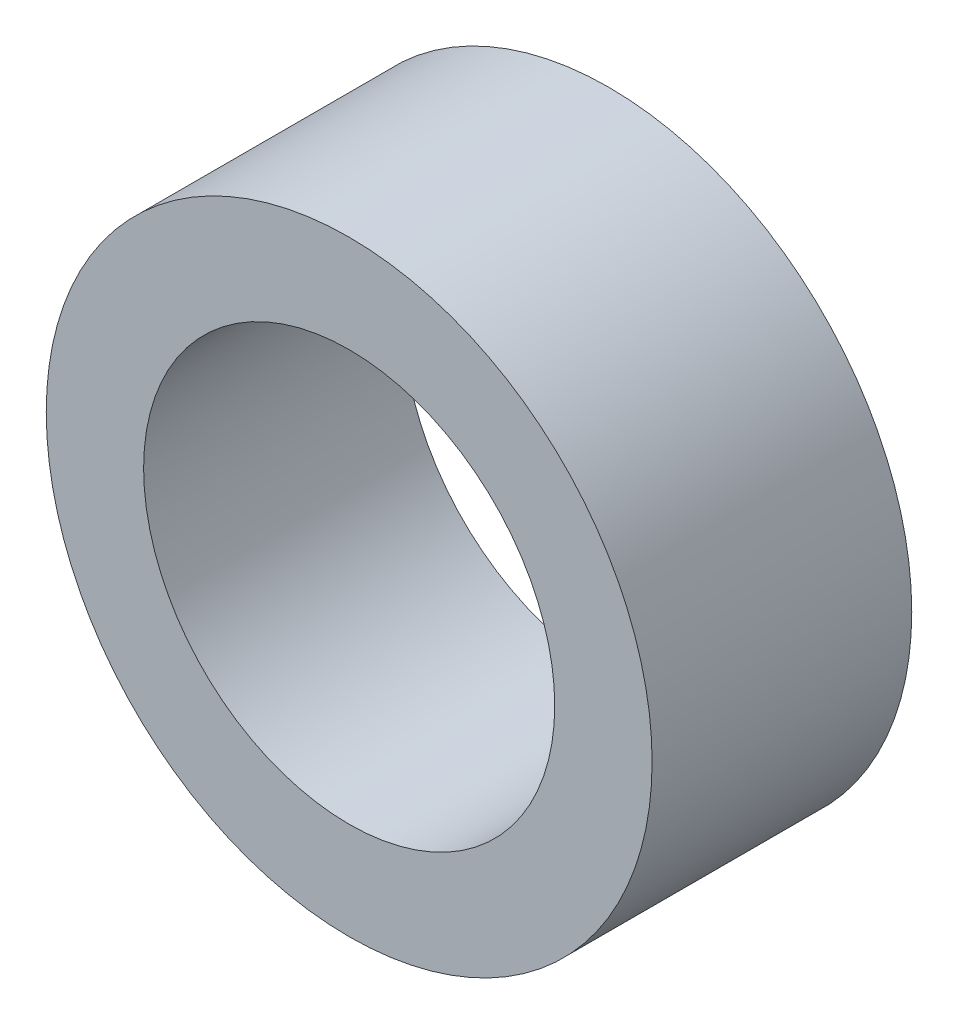
ISO-10303-21;
HEADER;
FILE_DESCRIPTION(('STEP AP214'),'2;1');
FILE_NAME('part.step','',(''),(''),'','','');
FILE_SCHEMA(('AUTOMOTIVE_DESIGN { 1 0 10303 214 1 1 1 1 }'));
ENDSEC;
DATA;
#1=APPLICATION_CONTEXT('core data for automotive mechanical design processes');
#2=APPLICATION_PROTOCOL_DEFINITION('international standard','automotive_design',2000,#1);
#3=PRODUCT_CONTEXT('',#1,'mechanical');
#4=PRODUCT('Part','Part','',(#3));
#5=PRODUCT_RELATED_PRODUCT_CATEGORY('part','',(#4));
#6=PRODUCT_DEFINITION_FORMATION('','',#4);
#7=PRODUCT_DEFINITION_CONTEXT('part definition',#1,'design');
#8=PRODUCT_DEFINITION('design','',#6,#7);
#9=PRODUCT_DEFINITION_SHAPE('','',#8);
#10=(LENGTH_UNIT() NAMED_UNIT(*) SI_UNIT(.MILLI.,.METRE.));
#11=(NAMED_UNIT(*) PLANE_ANGLE_UNIT() SI_UNIT($,.RADIAN.));
#12=(NAMED_UNIT(*) SI_UNIT($,.STERADIAN.) SOLID_ANGLE_UNIT());
#13=UNCERTAINTY_MEASURE_WITH_UNIT(LENGTH_MEASURE(1.E-05),#10,'distance_accuracy_value','');
#14=(GEOMETRIC_REPRESENTATION_CONTEXT(3) GLOBAL_UNCERTAINTY_ASSIGNED_CONTEXT((#13)) GLOBAL_UNIT_ASSIGNED_CONTEXT((#10,
#11,#12)) REPRESENTATION_CONTEXT('',''));
#15=CARTESIAN_POINT('',(0.,0.,0.));
#16=DIRECTION('',(0.,0.,1.));
#17=DIRECTION('',(1.,0.,0.));
#18=AXIS2_PLACEMENT_3D('',#15,#16,#17);
#19=CARTESIAN_POINT('',(0.,0.,3.));
#20=DIRECTION('',(0.,0.,1.));
#21=DIRECTION('',(1.,0.,0.));
#22=AXIS2_PLACEMENT_3D('',#19,#20,#21);
#23=PLANE('',#22);
#24=CARTESIAN_POINT('',(0.,0.,3.));
#25=DIRECTION('',(0.,0.,1.));
#26=DIRECTION('',(1.,0.,0.));
#27=AXIS2_PLACEMENT_3D('',#24,#25,#26);
#28=CIRCLE('',#27,3.5);
#29=CARTESIAN_POINT('',(3.5,0.,3.));
#30=VERTEX_POINT('',#29);
#31=EDGE_CURVE('E10',#30,#30,#28,.T.);
#32=ORIENTED_EDGE('',*,*,#31,.T.);
#33=EDGE_LOOP('',(#32));
#34=FACE_BOUND('',#33,.T.);
#35=CARTESIAN_POINT('',(0.,0.,3.));
#36=DIRECTION('',(0.,0.,1.));
#37=DIRECTION('',(1.,0.,0.));
#38=AXIS2_PLACEMENT_3D('',#35,#36,#37);
#39=CIRCLE('',#38,2.375);
#40=CARTESIAN_POINT('',(2.375,0.,3.));
#41=VERTEX_POINT('',#40);
#42=EDGE_CURVE('E50',#41,#41,#39,.T.);
#43=ORIENTED_EDGE('',*,*,#42,.F.);
#44=EDGE_LOOP('',(#43));
#45=FACE_BOUND('',#44,.T.);
#46=ADVANCED_FACE('F37',(#34,#45),#23,.T.);
#47=CARTESIAN_POINT('',(0.,0.,0.));
#48=DIRECTION('',(0.,0.,1.));
#49=DIRECTION('',(1.,0.,0.));
#50=AXIS2_PLACEMENT_3D('',#47,#48,#49);
#51=PLANE('',#50);
#52=CARTESIAN_POINT('',(0.,0.,0.));
#53=DIRECTION('',(0.,0.,1.));
#54=DIRECTION('',(1.,0.,0.));
#55=AXIS2_PLACEMENT_3D('',#52,#53,#54);
#56=CIRCLE('',#55,3.5);
#57=CARTESIAN_POINT('',(3.5,0.,0.));
#58=VERTEX_POINT('',#57);
#59=EDGE_CURVE('E41',#58,#58,#56,.T.);
#60=ORIENTED_EDGE('',*,*,#59,.F.);
#61=EDGE_LOOP('',(#60));
#62=FACE_BOUND('',#61,.T.);
#63=CARTESIAN_POINT('',(0.,0.,0.));
#64=DIRECTION('',(0.,0.,1.));
#65=DIRECTION('',(1.,0.,0.));
#66=AXIS2_PLACEMENT_3D('',#63,#64,#65);
#67=CIRCLE('',#66,2.375);
#68=CARTESIAN_POINT('',(2.375,0.,0.));
#69=VERTEX_POINT('',#68);
#70=EDGE_CURVE('E52',#69,#69,#67,.T.);
#71=ORIENTED_EDGE('',*,*,#70,.T.);
#72=EDGE_LOOP('',(#71));
#73=FACE_BOUND('',#72,.T.);
#74=ADVANCED_FACE('F64',(#62,#73),#51,.F.);
#75=CARTESIAN_POINT('',(0.,0.,3.));
#76=DIRECTION('',(0.,0.,-1.));
#77=DIRECTION('',(-1.,0.,0.));
#78=AXIS2_PLACEMENT_3D('',#75,#76,#77);
#79=CYLINDRICAL_SURFACE('',#78,3.5);
#80=ORIENTED_EDGE('',*,*,#31,.F.);
#81=EDGE_LOOP('',(#80));
#82=FACE_BOUND('',#81,.T.);
#83=ORIENTED_EDGE('',*,*,#59,.T.);
#84=EDGE_LOOP('',(#83));
#85=FACE_BOUND('',#84,.T.);
#86=ADVANCED_FACE('F39',(#82,#85),#79,.T.);
#87=CARTESIAN_POINT('',(0.,0.,3.));
#88=DIRECTION('',(0.,0.,-1.));
#89=DIRECTION('',(-1.,0.,0.));
#90=AXIS2_PLACEMENT_3D('',#87,#88,#89);
#91=CYLINDRICAL_SURFACE('',#90,2.375);
#92=ORIENTED_EDGE('',*,*,#42,.T.);
#93=EDGE_LOOP('',(#92));
#94=FACE_BOUND('',#93,.T.);
#95=ORIENTED_EDGE('',*,*,#70,.F.);
#96=EDGE_LOOP('',(#95));
#97=FACE_BOUND('',#96,.T.);
#98=ADVANCED_FACE('F60',(#94,#97),#91,.F.);
#99=CLOSED_SHELL('',(#46,#74,#86,#98));
#100=MANIFOLD_SOLID_BREP('B2',#99);
#101=ADVANCED_BREP_SHAPE_REPRESENTATION('',(#18,#100),#14);
#102=SHAPE_DEFINITION_REPRESENTATION(#9,#101);
ENDSEC;
END-ISO-10303-21;
